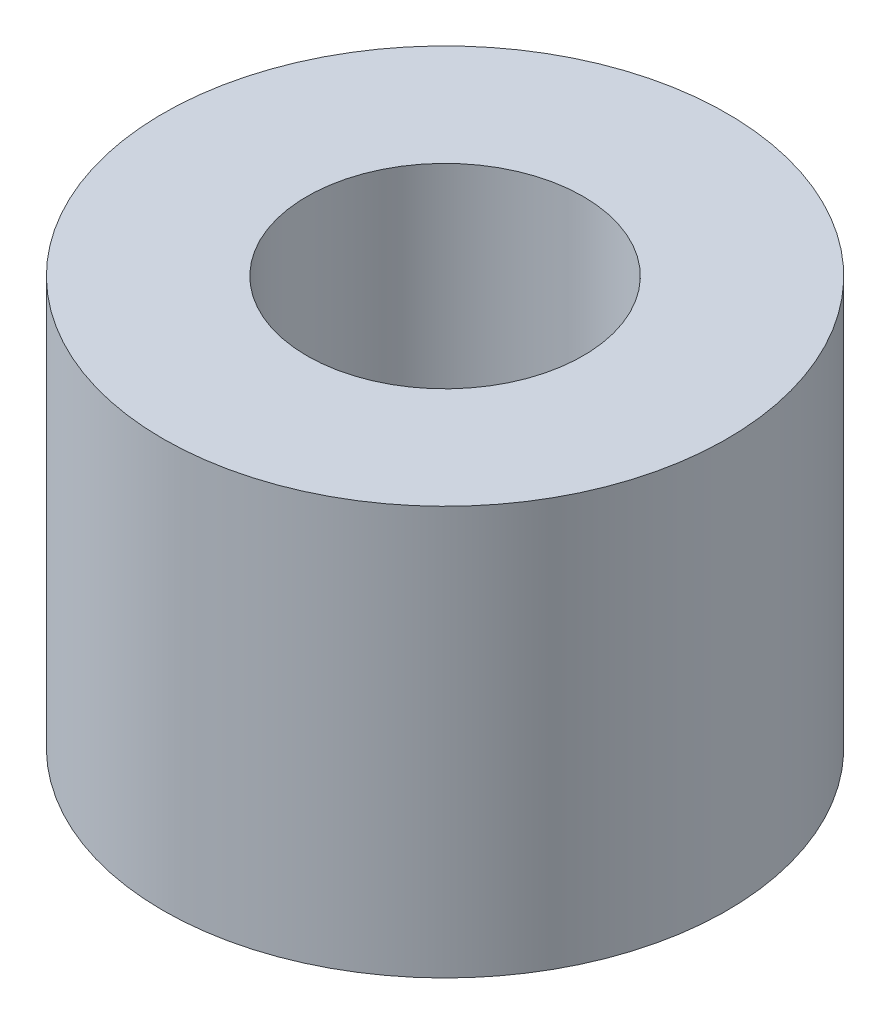
ISO-10303-21;
HEADER;
FILE_DESCRIPTION(('STEP AP214'),'2;1');
FILE_NAME('part.step','',(''),(''),'','','');
FILE_SCHEMA(('AUTOMOTIVE_DESIGN { 1 0 10303 214 1 1 1 1 }'));
ENDSEC;
DATA;
#1=APPLICATION_CONTEXT('core data for automotive mechanical design processes');
#2=APPLICATION_PROTOCOL_DEFINITION('international standard','automotive_design',2000,#1);
#3=PRODUCT_CONTEXT('',#1,'mechanical');
#4=PRODUCT('Part','Part','',(#3));
#5=PRODUCT_RELATED_PRODUCT_CATEGORY('part','',(#4));
#6=PRODUCT_DEFINITION_FORMATION('','',#4);
#7=PRODUCT_DEFINITION_CONTEXT('part definition',#1,'design');
#8=PRODUCT_DEFINITION('design','',#6,#7);
#9=PRODUCT_DEFINITION_SHAPE('','',#8);
#10=(LENGTH_UNIT() NAMED_UNIT(*) SI_UNIT(.MILLI.,.METRE.));
#11=(NAMED_UNIT(*) PLANE_ANGLE_UNIT() SI_UNIT($,.RADIAN.));
#12=(NAMED_UNIT(*) SI_UNIT($,.STERADIAN.) SOLID_ANGLE_UNIT());
#13=UNCERTAINTY_MEASURE_WITH_UNIT(LENGTH_MEASURE(1.E-05),#10,'distance_accuracy_value','');
#14=(GEOMETRIC_REPRESENTATION_CONTEXT(3) GLOBAL_UNCERTAINTY_ASSIGNED_CONTEXT((#13)) GLOBAL_UNIT_ASSIGNED_CONTEXT((#10,
#11,#12)) REPRESENTATION_CONTEXT('',''));
#15=CARTESIAN_POINT('',(0.,0.,0.));
#16=DIRECTION('',(0.,0.,1.));
#17=DIRECTION('',(1.,0.,0.));
#18=AXIS2_PLACEMENT_3D('',#15,#16,#17);
#19=CARTESIAN_POINT('',(0.,3.55,0.));
#20=DIRECTION('',(0.,1.,0.));
#21=DIRECTION('',(0.,0.,1.));
#22=AXIS2_PLACEMENT_3D('',#19,#20,#21);
#23=PLANE('',#22);
#24=CARTESIAN_POINT('',(0.,3.55,0.));
#25=DIRECTION('',(0.,1.,0.));
#26=DIRECTION('',(0.,0.,1.));
#27=AXIS2_PLACEMENT_3D('',#24,#25,#26);
#28=CIRCLE('',#27,2.45);
#29=CARTESIAN_POINT('',(0.,3.55,2.45));
#30=VERTEX_POINT('',#29);
#31=EDGE_CURVE('E10',#30,#30,#28,.T.);
#32=ORIENTED_EDGE('',*,*,#31,.T.);
#33=EDGE_LOOP('',(#32));
#34=FACE_BOUND('',#33,.T.);
#35=CARTESIAN_POINT('',(0.,3.55,0.));
#36=DIRECTION('',(0.,1.,0.));
#37=DIRECTION('',(0.,0.,1.));
#38=AXIS2_PLACEMENT_3D('',#35,#36,#37);
#39=CIRCLE('',#38,1.2);
#40=CARTESIAN_POINT('',(0.,3.55,1.2));
#41=VERTEX_POINT('',#40);
#42=EDGE_CURVE('E54',#41,#41,#39,.T.);
#43=ORIENTED_EDGE('',*,*,#42,.F.);
#44=EDGE_LOOP('',(#43));
#45=FACE_BOUND('',#44,.T.);
#46=ADVANCED_FACE('F43',(#34,#45),#23,.T.);
#47=CARTESIAN_POINT('',(0.,0.,0.));
#48=DIRECTION('',(0.,1.,0.));
#49=DIRECTION('',(0.,0.,1.));
#50=AXIS2_PLACEMENT_3D('',#47,#48,#49);
#51=PLANE('',#50);
#52=CARTESIAN_POINT('',(0.,0.,0.));
#53=DIRECTION('',(0.,1.,0.));
#54=DIRECTION('',(0.,0.,1.));
#55=AXIS2_PLACEMENT_3D('',#52,#53,#54);
#56=CIRCLE('',#55,2.45);
#57=CARTESIAN_POINT('',(0.,0.,2.45));
#58=VERTEX_POINT('',#57);
#59=EDGE_CURVE('E47',#58,#58,#56,.T.);
#60=ORIENTED_EDGE('',*,*,#59,.F.);
#61=EDGE_LOOP('',(#60));
#62=FACE_BOUND('',#61,.T.);
#63=CARTESIAN_POINT('',(0.,0.,0.));
#64=DIRECTION('',(0.,1.,0.));
#65=DIRECTION('',(0.,0.,1.));
#66=AXIS2_PLACEMENT_3D('',#63,#64,#65);
#67=CIRCLE('',#66,1.2);
#68=CARTESIAN_POINT('',(0.,0.,1.2));
#69=VERTEX_POINT('',#68);
#70=EDGE_CURVE('E56',#69,#69,#67,.T.);
#71=ORIENTED_EDGE('',*,*,#70,.T.);
#72=EDGE_LOOP('',(#71));
#73=FACE_BOUND('',#72,.T.);
#74=ADVANCED_FACE('F66',(#62,#73),#51,.F.);
#75=CARTESIAN_POINT('',(0.,3.55,0.));
#76=DIRECTION('',(0.,-1.,0.));
#77=DIRECTION('',(0.,0.,-1.));
#78=AXIS2_PLACEMENT_3D('',#75,#76,#77);
#79=CYLINDRICAL_SURFACE('',#78,2.45);
#80=ORIENTED_EDGE('',*,*,#31,.F.);
#81=EDGE_LOOP('',(#80));
#82=FACE_BOUND('',#81,.T.);
#83=ORIENTED_EDGE('',*,*,#59,.T.);
#84=EDGE_LOOP('',(#83));
#85=FACE_BOUND('',#84,.T.);
#86=ADVANCED_FACE('F45',(#82,#85),#79,.T.);
#87=CARTESIAN_POINT('',(0.,3.55,0.));
#88=DIRECTION('',(0.,-1.,0.));
#89=DIRECTION('',(0.,0.,-1.));
#90=AXIS2_PLACEMENT_3D('',#87,#88,#89);
#91=CYLINDRICAL_SURFACE('',#90,1.2);
#92=ORIENTED_EDGE('',*,*,#42,.T.);
#93=EDGE_LOOP('',(#92));
#94=FACE_BOUND('',#93,.T.);
#95=ORIENTED_EDGE('',*,*,#70,.F.);
#96=EDGE_LOOP('',(#95));
#97=FACE_BOUND('',#96,.T.);
#98=ADVANCED_FACE('F62',(#94,#97),#91,.F.);
#99=CLOSED_SHELL('',(#46,#74,#86,#98));
#100=MANIFOLD_SOLID_BREP('B2',#99);
#101=ADVANCED_BREP_SHAPE_REPRESENTATION('',(#18,#100),#14);
#102=SHAPE_DEFINITION_REPRESENTATION(#9,#101);
ENDSEC;
END-ISO-10303-21;
